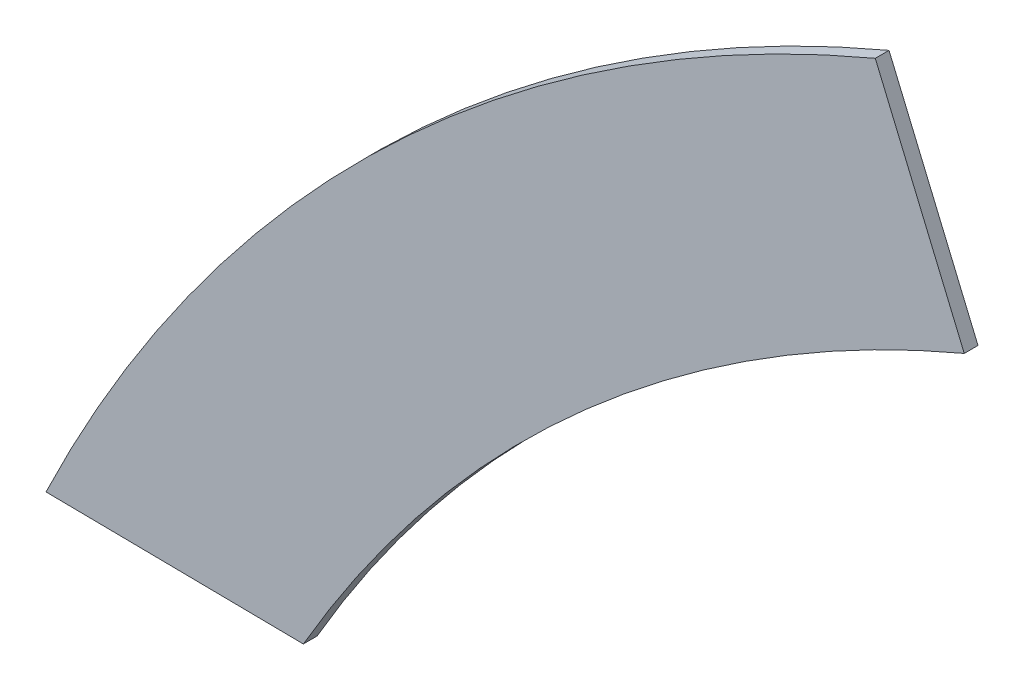
ISO-10303-21;
HEADER;
FILE_DESCRIPTION(('STEP AP214'),'2;1');
FILE_NAME('part.step','',(''),(''),'','','');
FILE_SCHEMA(('AUTOMOTIVE_DESIGN { 1 0 10303 214 1 1 1 1 }'));
ENDSEC;
DATA;
#1=APPLICATION_CONTEXT('core data for automotive mechanical design processes');
#2=APPLICATION_PROTOCOL_DEFINITION('international standard','automotive_design',2000,#1);
#3=PRODUCT_CONTEXT('',#1,'mechanical');
#4=PRODUCT('Part','Part','',(#3));
#5=PRODUCT_RELATED_PRODUCT_CATEGORY('part','',(#4));
#6=PRODUCT_DEFINITION_FORMATION('','',#4);
#7=PRODUCT_DEFINITION_CONTEXT('part definition',#1,'design');
#8=PRODUCT_DEFINITION('design','',#6,#7);
#9=PRODUCT_DEFINITION_SHAPE('','',#8);
#10=(LENGTH_UNIT() NAMED_UNIT(*) SI_UNIT(.MILLI.,.METRE.));
#11=(NAMED_UNIT(*) PLANE_ANGLE_UNIT() SI_UNIT($,.RADIAN.));
#12=(NAMED_UNIT(*) SI_UNIT($,.STERADIAN.) SOLID_ANGLE_UNIT());
#13=UNCERTAINTY_MEASURE_WITH_UNIT(LENGTH_MEASURE(1.E-05),#10,'distance_accuracy_value','');
#14=(GEOMETRIC_REPRESENTATION_CONTEXT(3) GLOBAL_UNCERTAINTY_ASSIGNED_CONTEXT((#13)) GLOBAL_UNIT_ASSIGNED_CONTEXT((#10,
#11,#12)) REPRESENTATION_CONTEXT('',''));
#15=CARTESIAN_POINT('',(0.,0.,0.));
#16=DIRECTION('',(0.,0.,1.));
#17=DIRECTION('',(1.,0.,0.));
#18=AXIS2_PLACEMENT_3D('',#15,#16,#17);
#19=CARTESIAN_POINT('',(731.902241037827,-952.917612900367,12.));
#20=DIRECTION('',(0.,0.,-1.));
#21=DIRECTION('',(-1.,0.,0.));
#22=AXIS2_PLACEMENT_3D('',#19,#20,#21);
#23=CYLINDRICAL_SURFACE('',#22,1210.55303377677);
#24=CARTESIAN_POINT('',(731.902241037827,-952.917612900367,0.));
#25=DIRECTION('',(0.,0.,1.));
#26=DIRECTION('',(1.,0.,0.));
#27=AXIS2_PLACEMENT_3D('',#24,#25,#26);
#28=CIRCLE('',#27,1210.55303377677);
#29=CARTESIAN_POINT('',(261.716980978861,162.593242631497,0.));
#30=VERTEX_POINT('',#29);
#31=CARTESIAN_POINT('',(-315.276644300236,-345.58324890614,0.));
#32=VERTEX_POINT('',#31);
#33=EDGE_CURVE('E98',#30,#32,#28,.T.);
#34=ORIENTED_EDGE('',*,*,#33,.F.);
#35=DIRECTION('',(0.,0.,-1.));
#36=VECTOR('',#35,1.);
#37=CARTESIAN_POINT('',(261.716980978861,162.593242631497,12.));
#38=LINE('',#37,#36);
#39=CARTESIAN_POINT('',(261.716980978861,162.593242631497,12.));
#40=VERTEX_POINT('',#39);
#41=EDGE_CURVE('E11',#40,#30,#38,.T.);
#42=ORIENTED_EDGE('',*,*,#41,.F.);
#43=CARTESIAN_POINT('',(731.902241037827,-952.917612900367,12.));
#44=DIRECTION('',(0.,0.,1.));
#45=DIRECTION('',(1.,0.,0.));
#46=AXIS2_PLACEMENT_3D('',#43,#44,#45);
#47=CIRCLE('',#46,1210.55303377677);
#48=CARTESIAN_POINT('',(-315.276644300236,-345.58324890614,12.));
#49=VERTEX_POINT('',#48);
#50=EDGE_CURVE('E92',#40,#49,#47,.T.);
#51=ORIENTED_EDGE('',*,*,#50,.T.);
#52=DIRECTION('',(0.,0.,-1.));
#53=VECTOR('',#52,1.);
#54=CARTESIAN_POINT('',(-315.276644300236,-345.58324890614,12.));
#55=LINE('',#54,#53);
#56=EDGE_CURVE('E73',#49,#32,#55,.T.);
#57=ORIENTED_EDGE('',*,*,#56,.T.);
#58=EDGE_LOOP('',(#34,#42,#51,#57));
#59=FACE_BOUND('',#58,.T.);
#60=ADVANCED_FACE('F35',(#59),#23,.F.);
#61=CARTESIAN_POINT('',(280.428622465165,118.200019415244,12.));
#62=DIRECTION('',(0.921488629086811,0.388405337841424,0.));
#63=DIRECTION('',(-0.388405337841424,0.921488629086811,0.));
#64=AXIS2_PLACEMENT_3D('',#61,#62,#63);
#65=PLANE('',#64);
#66=DIRECTION('',(0.388405337841424,-0.92148862908681,0.));
#67=VECTOR('',#66,1.);
#68=CARTESIAN_POINT('',(280.428622465165,118.200019415244,0.));
#69=LINE('',#68,#67);
#70=CARTESIAN_POINT('',(184.035913410578,346.890968448856,0.));
#71=VERTEX_POINT('',#70);
#72=EDGE_CURVE('E86',#71,#30,#69,.T.);
#73=ORIENTED_EDGE('',*,*,#72,.F.);
#74=DIRECTION('',(0.,0.,-1.));
#75=VECTOR('',#74,1.);
#76=CARTESIAN_POINT('',(184.035913410578,346.890968448856,12.));
#77=LINE('',#76,#75);
#78=CARTESIAN_POINT('',(184.035913410578,346.890968448856,12.));
#79=VERTEX_POINT('',#78);
#80=EDGE_CURVE('E43',#79,#71,#77,.T.);
#81=ORIENTED_EDGE('',*,*,#80,.F.);
#82=DIRECTION('',(0.388405337841424,-0.92148862908681,0.));
#83=VECTOR('',#82,1.);
#84=CARTESIAN_POINT('',(280.428622465165,118.200019415244,12.));
#85=LINE('',#84,#83);
#86=EDGE_CURVE('E84',#79,#40,#85,.T.);
#87=ORIENTED_EDGE('',*,*,#86,.T.);
#88=ORIENTED_EDGE('',*,*,#41,.T.);
#89=EDGE_LOOP('',(#73,#81,#87,#88));
#90=FACE_BOUND('',#89,.T.);
#91=ADVANCED_FACE('F82',(#90),#65,.T.);
#92=CARTESIAN_POINT('',(731.902241037827,-952.917612900367,12.));
#93=DIRECTION('',(0.,0.,-1.));
#94=DIRECTION('',(-1.,0.,0.));
#95=AXIS2_PLACEMENT_3D('',#92,#93,#94);
#96=CYLINDRICAL_SURFACE('',#95,1410.55303377677);
#97=CARTESIAN_POINT('',(731.902241037827,-952.917612900367,0.));
#98=DIRECTION('',(0.,0.,1.));
#99=DIRECTION('',(1.,0.,0.));
#100=AXIS2_PLACEMENT_3D('',#97,#98,#99);
#101=CIRCLE('',#100,1410.55303377677);
#102=CARTESIAN_POINT('',(-539.939349275968,-342.934965405437,0.));
#103=VERTEX_POINT('',#102);
#104=EDGE_CURVE('E66',#71,#103,#101,.T.);
#105=ORIENTED_EDGE('',*,*,#104,.T.);
#106=DIRECTION('',(0.,0.,-1.));
#107=VECTOR('',#106,1.);
#108=CARTESIAN_POINT('',(-539.939349275968,-342.934965405437,12.));
#109=LINE('',#108,#107);
#110=CARTESIAN_POINT('',(-539.939349275968,-342.934965405437,12.));
#111=VERTEX_POINT('',#110);
#112=EDGE_CURVE('E87',#111,#103,#109,.T.);
#113=ORIENTED_EDGE('',*,*,#112,.F.);
#114=CARTESIAN_POINT('',(731.902241037827,-952.917612900367,12.));
#115=DIRECTION('',(0.,0.,1.));
#116=DIRECTION('',(1.,0.,0.));
#117=AXIS2_PLACEMENT_3D('',#114,#115,#116);
#118=CIRCLE('',#117,1410.55303377677);
#119=EDGE_CURVE('E88',#79,#111,#118,.T.);
#120=ORIENTED_EDGE('',*,*,#119,.F.);
#121=ORIENTED_EDGE('',*,*,#80,.T.);
#122=EDGE_LOOP('',(#105,#113,#120,#121));
#123=FACE_BOUND('',#122,.T.);
#124=ADVANCED_FACE('F89',(#123),#96,.T.);
#125=CARTESIAN_POINT('',(-4.11690957724381,-349.251143813926,12.));
#126=DIRECTION('',(0.0117870009937494,0.999930530890808,0.));
#127=DIRECTION('',(-0.999930530890808,0.0117870009937494,0.));
#128=AXIS2_PLACEMENT_3D('',#125,#126,#127);
#129=PLANE('',#128);
#130=DIRECTION('',(0.999930530890808,-0.0117870009937494,0.));
#131=VECTOR('',#130,1.);
#132=CARTESIAN_POINT('',(-4.11690957724381,-349.251143813926,0.));
#133=LINE('',#132,#131);
#134=EDGE_CURVE('E94',#103,#32,#133,.T.);
#135=ORIENTED_EDGE('',*,*,#134,.T.);
#136=ORIENTED_EDGE('',*,*,#56,.F.);
#137=DIRECTION('',(0.999930530890808,-0.0117870009937494,0.));
#138=VECTOR('',#137,1.);
#139=CARTESIAN_POINT('',(-4.11690957724381,-349.251143813926,12.));
#140=LINE('',#139,#138);
#141=EDGE_CURVE('E51',#111,#49,#140,.T.);
#142=ORIENTED_EDGE('',*,*,#141,.F.);
#143=ORIENTED_EDGE('',*,*,#112,.T.);
#144=EDGE_LOOP('',(#135,#136,#142,#143));
#145=FACE_BOUND('',#144,.T.);
#146=ADVANCED_FACE('F107',(#145),#129,.F.);
#147=CARTESIAN_POINT('',(0.,0.,12.));
#148=DIRECTION('',(0.,0.,1.));
#149=DIRECTION('',(1.,0.,0.));
#150=AXIS2_PLACEMENT_3D('',#147,#148,#149);
#151=PLANE('',#150);
#152=ORIENTED_EDGE('',*,*,#50,.F.);
#153=ORIENTED_EDGE('',*,*,#86,.F.);
#154=ORIENTED_EDGE('',*,*,#119,.T.);
#155=ORIENTED_EDGE('',*,*,#141,.T.);
#156=EDGE_LOOP('',(#152,#153,#154,#155));
#157=FACE_BOUND('',#156,.T.);
#158=ADVANCED_FACE('F91',(#157),#151,.T.);
#159=CARTESIAN_POINT('',(0.,0.,0.));
#160=DIRECTION('',(0.,0.,1.));
#161=DIRECTION('',(1.,0.,0.));
#162=AXIS2_PLACEMENT_3D('',#159,#160,#161);
#163=PLANE('',#162);
#164=ORIENTED_EDGE('',*,*,#33,.T.);
#165=ORIENTED_EDGE('',*,*,#134,.F.);
#166=ORIENTED_EDGE('',*,*,#104,.F.);
#167=ORIENTED_EDGE('',*,*,#72,.T.);
#168=EDGE_LOOP('',(#164,#165,#166,#167));
#169=FACE_BOUND('',#168,.T.);
#170=ADVANCED_FACE('F109',(#169),#163,.F.);
#171=CLOSED_SHELL('',(#60,#91,#124,#146,#158,#170));
#172=MANIFOLD_SOLID_BREP('B2',#171);
#173=ADVANCED_BREP_SHAPE_REPRESENTATION('',(#18,#172),#14);
#174=SHAPE_DEFINITION_REPRESENTATION(#9,#173);
ENDSEC;
END-ISO-10303-21;
